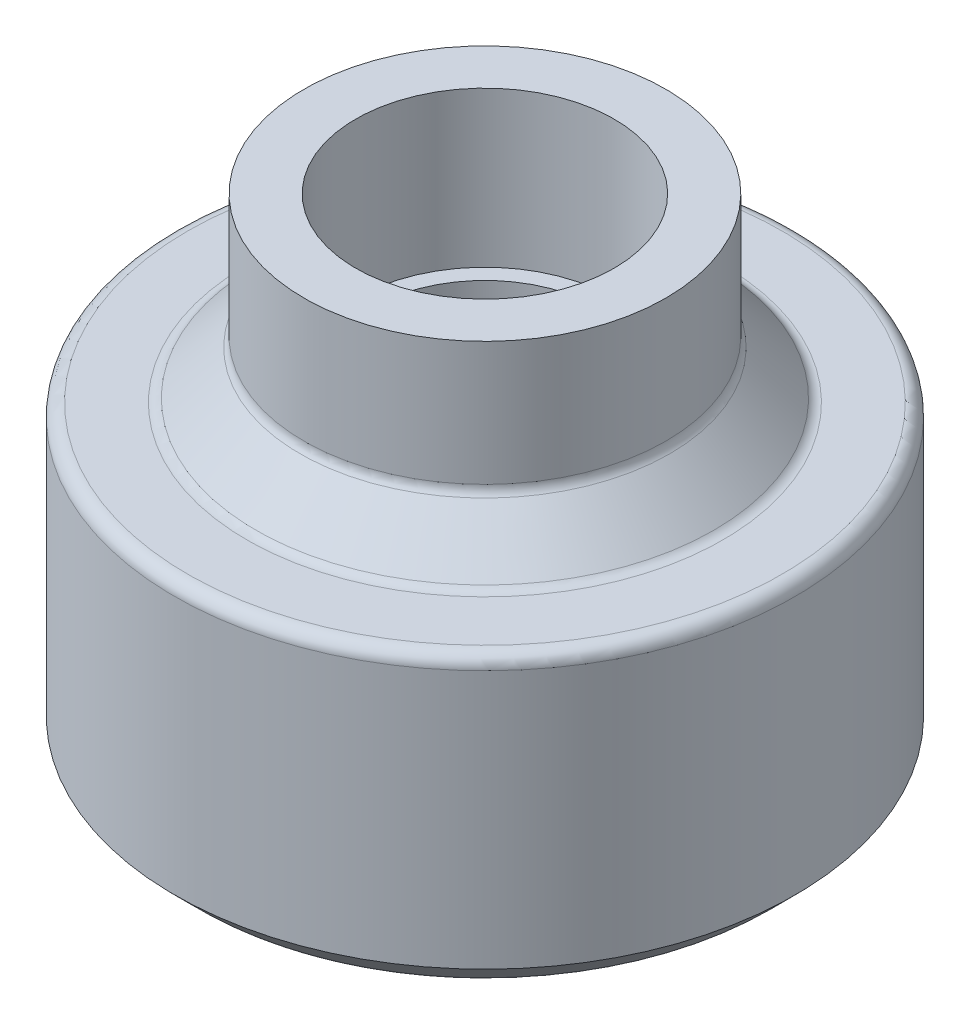
ISO-10303-21;
HEADER;
FILE_DESCRIPTION(('STEP AP214'),'2;1');
FILE_NAME('part.step','',(''),(''),'','','');
FILE_SCHEMA(('AUTOMOTIVE_DESIGN { 1 0 10303 214 1 1 1 1 }'));
ENDSEC;
DATA;
#1=APPLICATION_CONTEXT('core data for automotive mechanical design processes');
#2=APPLICATION_PROTOCOL_DEFINITION('international standard','automotive_design',2000,#1);
#3=PRODUCT_CONTEXT('',#1,'mechanical');
#4=PRODUCT('Part','Part','',(#3));
#5=PRODUCT_RELATED_PRODUCT_CATEGORY('part','',(#4));
#6=PRODUCT_DEFINITION_FORMATION('','',#4);
#7=PRODUCT_DEFINITION_CONTEXT('part definition',#1,'design');
#8=PRODUCT_DEFINITION('design','',#6,#7);
#9=PRODUCT_DEFINITION_SHAPE('','',#8);
#10=(LENGTH_UNIT() NAMED_UNIT(*) SI_UNIT(.MILLI.,.METRE.));
#11=(NAMED_UNIT(*) PLANE_ANGLE_UNIT() SI_UNIT($,.RADIAN.));
#12=(NAMED_UNIT(*) SI_UNIT($,.STERADIAN.) SOLID_ANGLE_UNIT());
#13=UNCERTAINTY_MEASURE_WITH_UNIT(LENGTH_MEASURE(1.E-05),#10,'distance_accuracy_value','');
#14=(GEOMETRIC_REPRESENTATION_CONTEXT(3) GLOBAL_UNCERTAINTY_ASSIGNED_CONTEXT((#13)) GLOBAL_UNIT_ASSIGNED_CONTEXT((#10,
#11,#12)) REPRESENTATION_CONTEXT('',''));
#15=CARTESIAN_POINT('',(0.,0.,0.));
#16=DIRECTION('',(0.,0.,1.));
#17=DIRECTION('',(1.,0.,0.));
#18=AXIS2_PLACEMENT_3D('',#15,#16,#17);
#19=CARTESIAN_POINT('',(0.,0.,0.));
#20=DIRECTION('',(0.,1.,0.));
#21=DIRECTION('',(-1.,0.,0.));
#22=AXIS2_PLACEMENT_3D('',#19,#20,#21);
#23=PLANE('',#22);
#24=CARTESIAN_POINT('',(0.,0.,0.));
#25=DIRECTION('',(0.,1.,0.));
#26=DIRECTION('',(0.,0.,1.));
#27=AXIS2_PLACEMENT_3D('',#24,#25,#26);
#28=CIRCLE('',#27,5.55625);
#29=CARTESIAN_POINT('',(0.,0.,5.55625));
#30=VERTEX_POINT('',#29);
#31=EDGE_CURVE('E80',#30,#30,#28,.T.);
#32=ORIENTED_EDGE('',*,*,#31,.F.);
#33=EDGE_LOOP('',(#32));
#34=FACE_BOUND('',#33,.T.);
#35=CARTESIAN_POINT('',(0.,0.,0.));
#36=DIRECTION('',(0.,-1.,0.));
#37=DIRECTION('',(1.,0.,0.));
#38=AXIS2_PLACEMENT_3D('',#35,#36,#37);
#39=CIRCLE('',#38,6.35);
#40=CARTESIAN_POINT('',(6.35,0.,0.));
#41=VERTEX_POINT('',#40);
#42=EDGE_CURVE('E71',#41,#41,#39,.T.);
#43=ORIENTED_EDGE('',*,*,#42,.F.);
#44=EDGE_LOOP('',(#43));
#45=FACE_BOUND('',#44,.T.);
#46=ADVANCED_FACE('F36',(#34,#45),#23,.T.);
#47=CARTESIAN_POINT('',(0.,-1033.0200000001,0.));
#48=DIRECTION('',(0.,-1.,0.));
#49=DIRECTION('',(1.,0.,0.));
#50=AXIS2_PLACEMENT_3D('',#47,#48,#49);
#51=CYLINDRICAL_SURFACE('',#50,6.35);
#52=ORIENTED_EDGE('',*,*,#42,.T.);
#53=EDGE_LOOP('',(#52));
#54=FACE_BOUND('',#53,.T.);
#55=CARTESIAN_POINT('',(0.,7.61999999999996,0.));
#56=DIRECTION('',(0.,-1.,0.));
#57=DIRECTION('',(1.,0.,0.));
#58=AXIS2_PLACEMENT_3D('',#55,#56,#57);
#59=CIRCLE('',#58,6.35);
#60=CARTESIAN_POINT('',(6.35,7.61999999999996,0.));
#61=VERTEX_POINT('',#60);
#62=EDGE_CURVE('E74',#61,#61,#59,.T.);
#63=ORIENTED_EDGE('',*,*,#62,.F.);
#64=EDGE_LOOP('',(#63));
#65=FACE_BOUND('',#64,.T.);
#66=ADVANCED_FACE('F108',(#54,#65),#51,.F.);
#67=CARTESIAN_POINT('',(6.35,7.62,0.));
#68=DIRECTION('',(0.,1.,0.));
#69=DIRECTION('',(-1.,0.,0.));
#70=AXIS2_PLACEMENT_3D('',#67,#68,#69);
#71=PLANE('',#70);
#72=ORIENTED_EDGE('',*,*,#62,.T.);
#73=EDGE_LOOP('',(#72));
#74=FACE_BOUND('',#73,.T.);
#75=CARTESIAN_POINT('',(0.,7.61999999999996,0.));
#76=DIRECTION('',(0.,-1.,0.));
#77=DIRECTION('',(1.,0.,0.));
#78=AXIS2_PLACEMENT_3D('',#75,#76,#77);
#79=CIRCLE('',#78,8.89);
#80=CARTESIAN_POINT('',(8.89,7.61999999999996,0.));
#81=VERTEX_POINT('',#80);
#82=EDGE_CURVE('E77',#81,#81,#79,.T.);
#83=ORIENTED_EDGE('',*,*,#82,.F.);
#84=EDGE_LOOP('',(#83));
#85=FACE_BOUND('',#84,.T.);
#86=ADVANCED_FACE('F114',(#74,#85),#71,.T.);
#87=CARTESIAN_POINT('',(0.,-1033.0200000001,0.));
#88=DIRECTION('',(0.,-1.,0.));
#89=DIRECTION('',(1.,0.,0.));
#90=AXIS2_PLACEMENT_3D('',#87,#88,#89);
#91=CYLINDRICAL_SURFACE('',#90,8.89);
#92=CARTESIAN_POINT('',(0.,1.53302561210711,0.));
#93=DIRECTION('',(0.,-1.,0.));
#94=DIRECTION('',(1.,0.,0.));
#95=AXIS2_PLACEMENT_3D('',#92,#93,#94);
#96=CIRCLE('',#95,8.89);
#97=CARTESIAN_POINT('',(8.89,1.53302561210711,0.));
#98=VERTEX_POINT('',#97);
#99=EDGE_CURVE('E59',#98,#98,#96,.F.);
#100=ORIENTED_EDGE('',*,*,#99,.T.);
#101=EDGE_LOOP('',(#100));
#102=FACE_BOUND('',#101,.T.);
#103=ORIENTED_EDGE('',*,*,#82,.T.);
#104=EDGE_LOOP('',(#103));
#105=FACE_BOUND('',#104,.T.);
#106=ADVANCED_FACE('F149',(#102,#105),#91,.T.);
#107=CARTESIAN_POINT('',(0.,-1.2700000000001,0.));
#108=DIRECTION('',(0.,-1.,0.));
#109=DIRECTION('',(1.,0.,0.));
#110=AXIS2_PLACEMENT_3D('',#107,#108,#109);
#111=CONICAL_SURFACE('',#110,11.43,0.785398163397407);
#112=CARTESIAN_POINT('',(0.,1.08401280605362,0.));
#113=DIRECTION('',(0.,-1.,0.));
#114=DIRECTION('',(1.,0.,0.));
#115=AXIS2_PLACEMENT_3D('',#112,#113,#114);
#116=CIRCLE('',#115,9.07598719394647);
#117=CARTESIAN_POINT('',(9.07598719394647,1.08401280605362,0.));
#118=VERTEX_POINT('',#117);
#119=EDGE_CURVE('E62',#118,#118,#116,.T.);
#120=ORIENTED_EDGE('',*,*,#119,.T.);
#121=EDGE_LOOP('',(#120));
#122=FACE_BOUND('',#121,.T.);
#123=CARTESIAN_POINT('',(0.,-1.08401280605344,0.));
#124=DIRECTION('',(0.,-1.,0.));
#125=DIRECTION('',(1.,0.,0.));
#126=AXIS2_PLACEMENT_3D('',#123,#124,#125);
#127=CIRCLE('',#126,11.2440128060534);
#128=CARTESIAN_POINT('',(11.2440128060534,-1.08401280605344,0.));
#129=VERTEX_POINT('',#128);
#130=EDGE_CURVE('E65',#129,#129,#127,.F.);
#131=ORIENTED_EDGE('',*,*,#130,.T.);
#132=EDGE_LOOP('',(#131));
#133=FACE_BOUND('',#132,.T.);
#134=ADVANCED_FACE('F143',(#122,#133),#111,.T.);
#135=CARTESIAN_POINT('',(11.43,-1.27,0.));
#136=DIRECTION('',(0.,1.,0.));
#137=DIRECTION('',(-1.,0.,0.));
#138=AXIS2_PLACEMENT_3D('',#135,#136,#137);
#139=PLANE('',#138);
#140=CARTESIAN_POINT('',(0.,-1.27,0.));
#141=DIRECTION('',(0.,1.,0.));
#142=DIRECTION('',(-1.,0.,0.));
#143=AXIS2_PLACEMENT_3D('',#140,#141,#142);
#144=CIRCLE('',#143,14.605);
#145=CARTESIAN_POINT('',(-14.605,-1.27,0.));
#146=VERTEX_POINT('',#145);
#147=EDGE_CURVE('E48',#146,#146,#144,.T.);
#148=ORIENTED_EDGE('',*,*,#147,.T.);
#149=EDGE_LOOP('',(#148));
#150=FACE_BOUND('',#149,.T.);
#151=CARTESIAN_POINT('',(0.,-1.27,0.));
#152=DIRECTION('',(0.,1.,0.));
#153=DIRECTION('',(-1.,0.,0.));
#154=AXIS2_PLACEMENT_3D('',#151,#152,#153);
#155=CIRCLE('',#154,11.6930256121068);
#156=CARTESIAN_POINT('',(-11.6930256121068,-1.27,0.));
#157=VERTEX_POINT('',#156);
#158=EDGE_CURVE('E53',#157,#157,#155,.F.);
#159=ORIENTED_EDGE('',*,*,#158,.T.);
#160=EDGE_LOOP('',(#159));
#161=FACE_BOUND('',#160,.T.);
#162=ADVANCED_FACE('F136',(#150,#161),#139,.T.);
#163=CARTESIAN_POINT('',(0.,-1033.0200000001,0.));
#164=DIRECTION('',(0.,-1.,0.));
#165=DIRECTION('',(1.,0.,0.));
#166=AXIS2_PLACEMENT_3D('',#163,#164,#165);
#167=CYLINDRICAL_SURFACE('',#166,15.24);
#168=CARTESIAN_POINT('',(0.,-1.90500000000005,0.));
#169=DIRECTION('',(0.,1.,0.));
#170=DIRECTION('',(-1.,0.,0.));
#171=AXIS2_PLACEMENT_3D('',#168,#169,#170);
#172=CIRCLE('',#171,15.24);
#173=CARTESIAN_POINT('',(-15.24,-1.90500000000005,0.));
#174=VERTEX_POINT('',#173);
#175=EDGE_CURVE('E56',#174,#174,#172,.F.);
#176=ORIENTED_EDGE('',*,*,#175,.T.);
#177=EDGE_LOOP('',(#176));
#178=FACE_BOUND('',#177,.T.);
#179=CARTESIAN_POINT('',(0.,-14.605,0.));
#180=DIRECTION('',(0.,-1.,0.));
#181=DIRECTION('',(1.,0.,0.));
#182=AXIS2_PLACEMENT_3D('',#179,#180,#181);
#183=CIRCLE('',#182,15.24);
#184=CARTESIAN_POINT('',(-15.24,-14.605,0.));
#185=VERTEX_POINT('',#184);
#186=EDGE_CURVE('E68',#185,#185,#183,.F.);
#187=ORIENTED_EDGE('',*,*,#186,.T.);
#188=EDGE_LOOP('',(#187));
#189=FACE_BOUND('',#188,.T.);
#190=ADVANCED_FACE('F93',(#178,#189),#167,.T.);
#191=CARTESIAN_POINT('',(0.,-5.83706885916513,0.));
#192=DIRECTION('',(0.,-1.,0.));
#193=DIRECTION('',(1.,0.,0.));
#194=AXIS2_PLACEMENT_3D('',#191,#192,#193);
#195=CONICAL_SURFACE('',#194,0.,0.918401990642502);
#196=CARTESIAN_POINT('',(0.,-10.0819846538154,0.));
#197=DIRECTION('',(0.,-1.,0.));
#198=DIRECTION('',(1.,0.,0.));
#199=AXIS2_PLACEMENT_3D('',#196,#197,#198);
#200=CIRCLE('',#199,5.55625);
#201=CARTESIAN_POINT('',(5.55625,-10.0819846538154,0.));
#202=VERTEX_POINT('',#201);
#203=EDGE_CURVE('E40',#202,#202,#200,.T.);
#204=ORIENTED_EDGE('',*,*,#203,.F.);
#205=EDGE_LOOP('',(#204));
#206=FACE_BOUND('',#205,.T.);
#207=CARTESIAN_POINT('',(0.,-15.8976195984611,0.));
#208=DIRECTION('',(0.,1.,0.));
#209=DIRECTION('',(-1.,0.,0.));
#210=AXIS2_PLACEMENT_3D('',#207,#208,#209);
#211=CIRCLE('',#210,13.1684437923742);
#212=CARTESIAN_POINT('',(-13.1684437923742,-15.8976195984611,0.));
#213=VERTEX_POINT('',#212);
#214=EDGE_CURVE('E44',#213,#213,#211,.F.);
#215=ORIENTED_EDGE('',*,*,#214,.T.);
#216=EDGE_LOOP('',(#215));
#217=FACE_BOUND('',#216,.T.);
#218=ADVANCED_FACE('F89',(#206,#217),#195,.F.);
#219=CARTESIAN_POINT('',(0.,-16.51,0.));
#220=DIRECTION('',(0.,1.,0.));
#221=DIRECTION('',(-1.,0.,0.));
#222=AXIS2_PLACEMENT_3D('',#219,#220,#221);
#223=CONICAL_SURFACE('',#222,13.335,0.785398163397445);
#224=CARTESIAN_POINT('',(0.,-15.8420407680739,0.));
#225=DIRECTION('',(0.,-1.,0.));
#226=DIRECTION('',(1.,0.,0.));
#227=AXIS2_PLACEMENT_3D('',#224,#225,#226);
#228=CIRCLE('',#227,14.002959231926);
#229=CARTESIAN_POINT('',(-14.0029592319261,-15.8420407680739,0.));
#230=VERTEX_POINT('',#229);
#231=EDGE_CURVE('E10',#230,#230,#228,.F.);
#232=CARTESIAN_POINT('',(-14.0029592319261,-15.8420407680739,0.));
#233=CARTESIAN_POINT('',(-14.0158450732602,-15.8291549267398,0.));
#234=CARTESIAN_POINT('',(-14.0287309145943,-15.8162690854057,0.));
#235=CARTESIAN_POINT('',(-14.0545025972625,-15.7904974027375,0.));
#236=CARTESIAN_POINT('',(-14.0673884385966,-15.7776115614034,0.));
#237=CARTESIAN_POINT('',(-14.0931601212648,-15.7518398787352,0.));
#238=CARTESIAN_POINT('',(-14.1060459625989,-15.7389540374011,0.));
#239=CARTESIAN_POINT('',(-14.1318176452671,-15.7131823547329,0.));
#240=CARTESIAN_POINT('',(-14.1447034866012,-15.7002965133988,0.));
#241=CARTESIAN_POINT('',(-14.1704751692694,-15.6745248307306,0.));
#242=CARTESIAN_POINT('',(-14.1833610106035,-15.6616389893965,0.));
#243=CARTESIAN_POINT('',(-14.2091326932717,-15.6358673067283,0.));
#244=CARTESIAN_POINT('',(-14.2220185346058,-15.6229814653942,0.));
#245=CARTESIAN_POINT('',(-14.247790217274,-15.597209782726,0.));
#246=CARTESIAN_POINT('',(-14.2606760586081,-15.5843239413919,0.));
#247=CARTESIAN_POINT('',(-14.2864477412763,-15.5585522587237,0.));
#248=CARTESIAN_POINT('',(-14.2993335826104,-15.5456664173896,0.));
#249=CARTESIAN_POINT('',(-14.3251052652786,-15.5198947347213,0.));
#250=CARTESIAN_POINT('',(-14.3379911066127,-15.5070088933872,0.));
#251=CARTESIAN_POINT('',(-14.363762789281,-15.481237210719,0.));
#252=CARTESIAN_POINT('',(-14.3766486306151,-15.4683513693849,0.));
#253=CARTESIAN_POINT('',(-14.4024203132833,-15.4425796867167,0.));
#254=CARTESIAN_POINT('',(-14.4153061546174,-15.4296938453826,0.));
#255=CARTESIAN_POINT('',(-14.4410778372856,-15.4039221627144,0.));
#256=CARTESIAN_POINT('',(-14.4539636786197,-15.3910363213803,0.));
#257=CARTESIAN_POINT('',(-14.4797353612879,-15.3652646387121,0.));
#258=CARTESIAN_POINT('',(-14.492621202622,-15.352378797378,0.));
#259=CARTESIAN_POINT('',(-14.5183928852902,-15.3266071147098,0.));
#260=CARTESIAN_POINT('',(-14.5312787266243,-15.3137212733757,0.));
#261=CARTESIAN_POINT('',(-14.5570504092925,-15.2879495907075,0.));
#262=CARTESIAN_POINT('',(-14.5699362506266,-15.2750637493734,0.));
#263=CARTESIAN_POINT('',(-14.5957079332948,-15.2492920667052,0.));
#264=CARTESIAN_POINT('',(-14.6085937746289,-15.2364062253711,0.));
#265=CARTESIAN_POINT('',(-14.6343654572971,-15.2106345427029,0.));
#266=CARTESIAN_POINT('',(-14.6472512986312,-15.1977487013688,0.));
#267=CARTESIAN_POINT('',(-14.6730229812994,-15.1719770187005,0.));
#268=CARTESIAN_POINT('',(-14.6859088226335,-15.1590911773664,0.));
#269=CARTESIAN_POINT('',(-14.7116805053018,-15.1333194946982,0.));
#270=CARTESIAN_POINT('',(-14.7245663466359,-15.1204336533641,0.));
#271=CARTESIAN_POINT('',(-14.7503380293041,-15.0946619706959,0.));
#272=CARTESIAN_POINT('',(-14.7632238706382,-15.0817761293618,0.));
#273=CARTESIAN_POINT('',(-14.7889955533064,-15.0560044466936,0.));
#274=CARTESIAN_POINT('',(-14.8018813946405,-15.0431186053595,0.));
#275=CARTESIAN_POINT('',(-14.8276530773087,-15.0173469226913,0.));
#276=CARTESIAN_POINT('',(-14.8405389186428,-15.0044610813572,0.));
#277=CARTESIAN_POINT('',(-14.866310601311,-14.978689398689,0.));
#278=CARTESIAN_POINT('',(-14.8791964426451,-14.9658035573549,0.));
#279=CARTESIAN_POINT('',(-14.9049681253133,-14.9400318746867,0.));
#280=CARTESIAN_POINT('',(-14.9178539666474,-14.9271460333526,0.));
#281=CARTESIAN_POINT('',(-14.9436256493156,-14.9013743506844,0.));
#282=CARTESIAN_POINT('',(-14.9565114906497,-14.8884885093503,0.));
#283=CARTESIAN_POINT('',(-14.9822831733179,-14.8627168266821,0.));
#284=CARTESIAN_POINT('',(-14.995169014652,-14.8498309853479,0.));
#285=CARTESIAN_POINT('',(-15.0209406973202,-14.8240593026797,0.));
#286=CARTESIAN_POINT('',(-15.0338265386543,-14.8111734613456,0.));
#287=CARTESIAN_POINT('',(-15.0595982213226,-14.7854017786774,0.));
#288=CARTESIAN_POINT('',(-15.0724840626567,-14.7725159373433,0.));
#289=CARTESIAN_POINT('',(-15.0982557453249,-14.7467442546751,0.));
#290=CARTESIAN_POINT('',(-15.111141586659,-14.733858413341,0.));
#291=CARTESIAN_POINT('',(-15.1369132693272,-14.7080867306728,0.));
#292=CARTESIAN_POINT('',(-15.1497991106613,-14.6952008893387,0.));
#293=CARTESIAN_POINT('',(-15.1755707933295,-14.6694292066705,0.));
#294=CARTESIAN_POINT('',(-15.1884566346636,-14.6565433653364,0.));
#295=CARTESIAN_POINT('',(-15.2142283173318,-14.6307716826682,0.));
#296=CARTESIAN_POINT('',(-15.2271141586659,-14.6178858413341,0.));
#297=CARTESIAN_POINT('',(-15.24,-14.605,0.));
#298=B_SPLINE_CURVE_WITH_KNOTS('',3,(#232,#233,#234,#235,#236,#237,#238,#239,#240,#241,#242,
#243,#244,#245,#246,#247,#248,#249,#250,#251,#252,#253,#254,#255,#256,#257,#258,#259,#260,#261,
#262,#263,#264,#265,#266,#267,#268,#269,#270,#271,#272,#273,#274,#275,#276,#277,#278,#279,#280,
#281,#282,#283,#284,#285,#286,#287,#288,#289,#290,#291,#292,#293,#294,#295,#296,#297),
.UNSPECIFIED.,.F.,.F.,(4,2,2,2,2,2,2,2,2,2,2,2,2,2,2,2,2,2,2,2,2,2,2,2,2,2,2,2,2,2,2,2,4),(0.,
0.054669994731832,0.109339989463663,0.164009984195495,0.218679978927324,0.273349973659156,
0.32801996839099,0.382689963122822,0.437359957854653,0.492029952586485,0.546699947318317,
0.601369942050149,0.656039936781981,0.710709931513813,0.765379926245645,0.820049920977477,
0.874719915709308,0.92938991044114,0.984059905172972,1.0387298999048,1.09339989463664,
1.14806988936847,1.2027398841003,1.25740987883213,1.31207987356396,1.3667498682958,
1.42141986302763,1.47608985775946,1.53075985249129,1.58542984722312,1.64009984195495,
1.69476983668679,1.74943983141862),.UNSPECIFIED.);
#299=EDGE_CURVE('BSEAM92',#230,#185,#298,.T.);
#300=ORIENTED_EDGE('',*,*,#231,.T.);
#301=ORIENTED_EDGE('',*,*,#186,.F.);
#302=ORIENTED_EDGE('',*,*,#299,.T.);
#303=ORIENTED_EDGE('',*,*,#299,.F.);
#304=EDGE_LOOP('',(#300,#302,#301,#303));
#305=FACE_BOUND('',#304,.T.);
#306=ADVANCED_FACE('F92',(#305),#223,.T.);
#307=CARTESIAN_POINT('',(0.,1.53302561210711,0.));
#308=DIRECTION('',(0.,-1.,0.));
#309=DIRECTION('',(1.,0.,0.));
#310=AXIS2_PLACEMENT_3D('',#307,#308,#309);
#311=TOROIDAL_SURFACE('',#310,9.525,0.635);
#312=ORIENTED_EDGE('',*,*,#99,.F.);
#313=EDGE_LOOP('',(#312));
#314=FACE_BOUND('',#313,.T.);
#315=ORIENTED_EDGE('',*,*,#119,.F.);
#316=EDGE_LOOP('',(#315));
#317=FACE_BOUND('',#316,.T.);
#318=ADVANCED_FACE('F122',(#314,#317),#311,.F.);
#319=CARTESIAN_POINT('',(0.,-1.90500000000005,0.));
#320=DIRECTION('',(0.,1.,0.));
#321=DIRECTION('',(-1.,0.,0.));
#322=AXIS2_PLACEMENT_3D('',#319,#320,#321);
#323=TOROIDAL_SURFACE('',#322,14.605,0.635);
#324=ORIENTED_EDGE('',*,*,#147,.F.);
#325=EDGE_LOOP('',(#324));
#326=FACE_BOUND('',#325,.T.);
#327=ORIENTED_EDGE('',*,*,#175,.F.);
#328=EDGE_LOOP('',(#327));
#329=FACE_BOUND('',#328,.T.);
#330=ADVANCED_FACE('F105',(#326,#329),#323,.T.);
#331=CARTESIAN_POINT('',(0.,-0.635000000000003,0.));
#332=DIRECTION('',(0.,1.,0.));
#333=DIRECTION('',(-1.,0.,0.));
#334=AXIS2_PLACEMENT_3D('',#331,#332,#333);
#335=TOROIDAL_SURFACE('',#334,11.6930256121068,0.635);
#336=ORIENTED_EDGE('',*,*,#130,.F.);
#337=EDGE_LOOP('',(#336));
#338=FACE_BOUND('',#337,.T.);
#339=ORIENTED_EDGE('',*,*,#158,.F.);
#340=EDGE_LOOP('',(#339));
#341=FACE_BOUND('',#340,.T.);
#342=ADVANCED_FACE('F98',(#338,#341),#335,.F.);
#343=CARTESIAN_POINT('',(0.,-15.3930279620205,0.));
#344=DIRECTION('',(0.,1.,0.));
#345=DIRECTION('',(-1.,0.,0.));
#346=AXIS2_PLACEMENT_3D('',#343,#344,#345);
#347=TOROIDAL_SURFACE('',#346,13.5539464258726,0.635);
#348=ORIENTED_EDGE('',*,*,#231,.F.);
#349=EDGE_LOOP('',(#348));
#350=FACE_BOUND('',#349,.T.);
#351=ORIENTED_EDGE('',*,*,#214,.F.);
#352=EDGE_LOOP('',(#351));
#353=FACE_BOUND('',#352,.T.);
#354=ADVANCED_FACE('F38',(#350,#353),#347,.T.);
#355=CARTESIAN_POINT('',(0.,0.,0.));
#356=DIRECTION('',(0.,1.,0.));
#357=DIRECTION('',(0.,0.,1.));
#358=AXIS2_PLACEMENT_3D('',#355,#356,#357);
#359=CYLINDRICAL_SURFACE('',#358,5.55625);
#360=ORIENTED_EDGE('',*,*,#203,.T.);
#361=EDGE_LOOP('',(#360));
#362=FACE_BOUND('',#361,.T.);
#363=ORIENTED_EDGE('',*,*,#31,.T.);
#364=EDGE_LOOP('',(#363));
#365=FACE_BOUND('',#364,.T.);
#366=ADVANCED_FACE('F87',(#362,#365),#359,.F.);
#367=CLOSED_SHELL('',(#46,#66,#86,#106,#134,#162,#190,#218,#306,#318,#330,#342,#354,#366));
#368=MANIFOLD_SOLID_BREP('B2',#367);
#369=ADVANCED_BREP_SHAPE_REPRESENTATION('',(#18,#368),#14);
#370=SHAPE_DEFINITION_REPRESENTATION(#9,#369);
ENDSEC;
END-ISO-10303-21;
